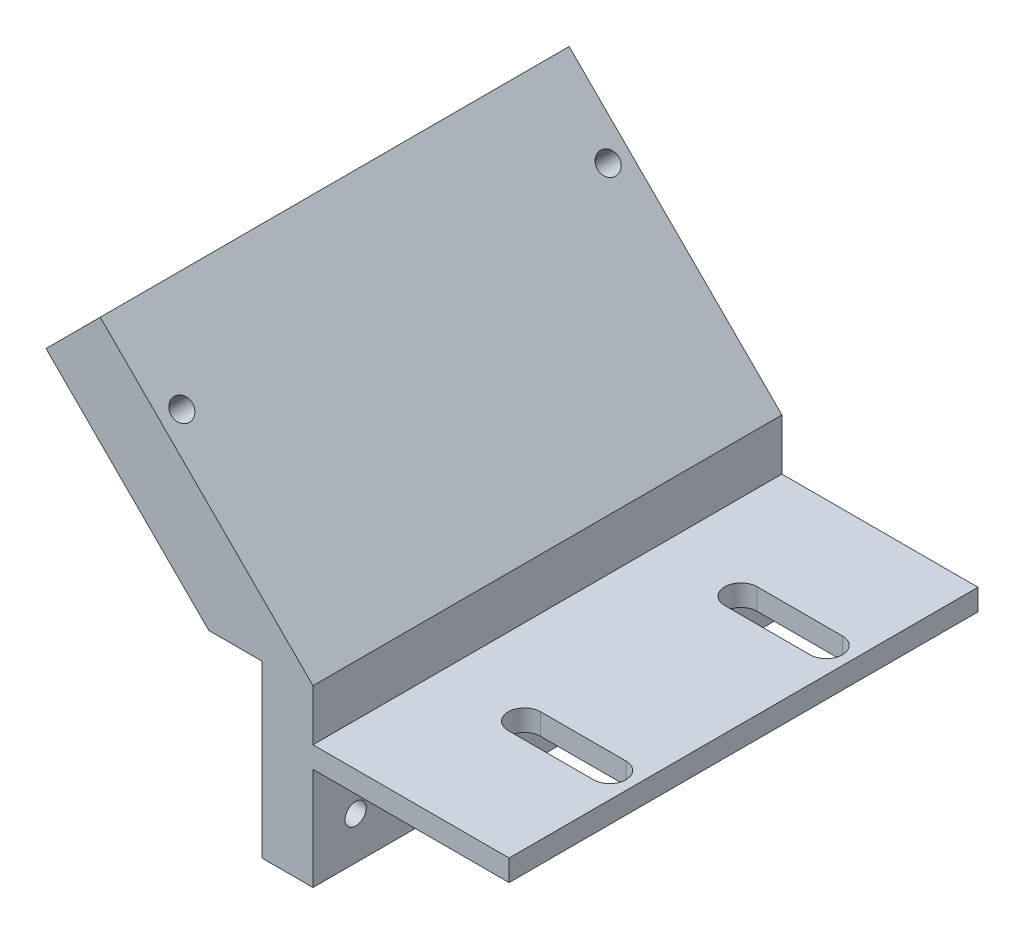
ISO-10303-21;
HEADER;
FILE_DESCRIPTION(('STEP AP214'),'2;1');
FILE_NAME('part.step','',(''),(''),'','','');
FILE_SCHEMA(('AUTOMOTIVE_DESIGN { 1 0 10303 214 1 1 1 1 }'));
ENDSEC;
DATA;
#1=APPLICATION_CONTEXT('core data for automotive mechanical design processes');
#2=APPLICATION_PROTOCOL_DEFINITION('international standard','automotive_design',2000,#1);
#3=PRODUCT_CONTEXT('',#1,'mechanical');
#4=PRODUCT('Part','Part','',(#3));
#5=PRODUCT_RELATED_PRODUCT_CATEGORY('part','',(#4));
#6=PRODUCT_DEFINITION_FORMATION('','',#4);
#7=PRODUCT_DEFINITION_CONTEXT('part definition',#1,'design');
#8=PRODUCT_DEFINITION('design','',#6,#7);
#9=PRODUCT_DEFINITION_SHAPE('','',#8);
#10=(LENGTH_UNIT() NAMED_UNIT(*) SI_UNIT(.MILLI.,.METRE.));
#11=(NAMED_UNIT(*) PLANE_ANGLE_UNIT() SI_UNIT($,.RADIAN.));
#12=(NAMED_UNIT(*) SI_UNIT($,.STERADIAN.) SOLID_ANGLE_UNIT());
#13=UNCERTAINTY_MEASURE_WITH_UNIT(LENGTH_MEASURE(1.E-05),#10,'distance_accuracy_value','');
#14=(GEOMETRIC_REPRESENTATION_CONTEXT(3) GLOBAL_UNCERTAINTY_ASSIGNED_CONTEXT((#13)) GLOBAL_UNIT_ASSIGNED_CONTEXT((#10,
#11,#12)) REPRESENTATION_CONTEXT('',''));
#15=CARTESIAN_POINT('',(0.,0.,0.));
#16=DIRECTION('',(0.,0.,1.));
#17=DIRECTION('',(1.,0.,0.));
#18=AXIS2_PLACEMENT_3D('',#15,#16,#17);
#19=CARTESIAN_POINT('',(0.,2.5,27.5));
#20=DIRECTION('',(-1.,0.,0.));
#21=DIRECTION('',(0.,0.,1.));
#22=AXIS2_PLACEMENT_3D('',#19,#20,#21);
#23=PLANE('',#22);
#24=DIRECTION('',(0.,1.,0.));
#25=VECTOR('',#24,1.);
#26=CARTESIAN_POINT('',(0.,2.5,-27.5));
#27=LINE('',#26,#25);
#28=CARTESIAN_POINT('',(0.,0.,-27.5));
#29=VERTEX_POINT('',#28);
#30=CARTESIAN_POINT('',(0.,2.5,-27.5));
#31=VERTEX_POINT('',#30);
#32=EDGE_CURVE('E181',#29,#31,#27,.T.);
#33=ORIENTED_EDGE('',*,*,#32,.T.);
#34=DIRECTION('',(0.,0.,-1.));
#35=VECTOR('',#34,1.);
#36=CARTESIAN_POINT('',(0.,2.5,27.5));
#37=LINE('',#36,#35);
#38=CARTESIAN_POINT('',(0.,2.5,27.5));
#39=VERTEX_POINT('',#38);
#40=EDGE_CURVE('E11',#39,#31,#37,.T.);
#41=ORIENTED_EDGE('',*,*,#40,.F.);
#42=DIRECTION('',(0.,1.,0.));
#43=VECTOR('',#42,1.);
#44=CARTESIAN_POINT('',(0.,2.5,27.5));
#45=LINE('',#44,#43);
#46=CARTESIAN_POINT('',(0.,0.,27.5));
#47=VERTEX_POINT('',#46);
#48=EDGE_CURVE('E235',#47,#39,#45,.T.);
#49=ORIENTED_EDGE('',*,*,#48,.F.);
#50=DIRECTION('',(0.,0.,-1.));
#51=VECTOR('',#50,1.);
#52=CARTESIAN_POINT('',(0.,0.,27.5));
#53=LINE('',#52,#51);
#54=EDGE_CURVE('E259',#47,#29,#53,.T.);
#55=ORIENTED_EDGE('',*,*,#54,.T.);
#56=EDGE_LOOP('',(#33,#41,#49,#55));
#57=FACE_BOUND('',#56,.T.);
#58=ADVANCED_FACE('F35',(#57),#23,.F.);
#59=CARTESIAN_POINT('',(-23.,2.5,27.5));
#60=DIRECTION('',(0.,-1.,0.));
#61=DIRECTION('',(1.,0.,0.));
#62=AXIS2_PLACEMENT_3D('',#59,#60,#61);
#63=PLANE('',#62);
#64=DIRECTION('',(1.,0.,0.));
#65=VECTOR('',#64,1.);
#66=CARTESIAN_POINT('',(-13.,2.5,14.605));
#67=LINE('',#66,#65);
#68=CARTESIAN_POINT('',(-13.,2.5,14.605));
#69=VERTEX_POINT('',#68);
#70=CARTESIAN_POINT('',(-3.,2.5,14.605));
#71=VERTEX_POINT('',#70);
#72=EDGE_CURVE('E189',#69,#71,#67,.T.);
#73=ORIENTED_EDGE('',*,*,#72,.F.);
#74=CARTESIAN_POINT('',(-13.,2.5,12.7));
#75=DIRECTION('',(0.,1.,0.));
#76=DIRECTION('',(0.,0.,1.));
#77=AXIS2_PLACEMENT_3D('',#74,#75,#76);
#78=CIRCLE('',#77,1.905);
#79=CARTESIAN_POINT('',(-13.,2.5,10.795));
#80=VERTEX_POINT('',#79);
#81=EDGE_CURVE('E49',#80,#69,#78,.T.);
#82=ORIENTED_EDGE('',*,*,#81,.F.);
#83=DIRECTION('',(-1.,0.,0.));
#84=VECTOR('',#83,1.);
#85=CARTESIAN_POINT('',(-13.,2.5,10.795));
#86=LINE('',#85,#84);
#87=CARTESIAN_POINT('',(-3.,2.5,10.795));
#88=VERTEX_POINT('',#87);
#89=EDGE_CURVE('E173',#88,#80,#86,.T.);
#90=ORIENTED_EDGE('',*,*,#89,.F.);
#91=CARTESIAN_POINT('',(-3.,2.5,12.7));
#92=DIRECTION('',(0.,1.,0.));
#93=DIRECTION('',(0.,0.,1.));
#94=AXIS2_PLACEMENT_3D('',#91,#92,#93);
#95=CIRCLE('',#94,1.905);
#96=EDGE_CURVE('E196',#71,#88,#95,.T.);
#97=ORIENTED_EDGE('',*,*,#96,.F.);
#98=EDGE_LOOP('',(#73,#82,#90,#97));
#99=FACE_BOUND('',#98,.T.);
#100=DIRECTION('',(1.,0.,0.));
#101=VECTOR('',#100,1.);
#102=CARTESIAN_POINT('',(-13.,2.5,-10.795));
#103=LINE('',#102,#101);
#104=CARTESIAN_POINT('',(-13.,2.5,-10.795));
#105=VERTEX_POINT('',#104);
#106=CARTESIAN_POINT('',(-3.,2.5,-10.795));
#107=VERTEX_POINT('',#106);
#108=EDGE_CURVE('E215',#105,#107,#103,.T.);
#109=ORIENTED_EDGE('',*,*,#108,.F.);
#110=CARTESIAN_POINT('',(-13.,2.5,-12.7));
#111=DIRECTION('',(0.,1.,0.));
#112=DIRECTION('',(0.,0.,-1.));
#113=AXIS2_PLACEMENT_3D('',#110,#111,#112);
#114=CIRCLE('',#113,1.905);
#115=CARTESIAN_POINT('',(-13.,2.5,-14.605));
#116=VERTEX_POINT('',#115);
#117=EDGE_CURVE('E57',#116,#105,#114,.T.);
#118=ORIENTED_EDGE('',*,*,#117,.F.);
#119=DIRECTION('',(-1.,0.,0.));
#120=VECTOR('',#119,1.);
#121=CARTESIAN_POINT('',(-13.,2.5,-14.605));
#122=LINE('',#121,#120);
#123=CARTESIAN_POINT('',(-3.,2.5,-14.605));
#124=VERTEX_POINT('',#123);
#125=EDGE_CURVE('E221',#124,#116,#122,.T.);
#126=ORIENTED_EDGE('',*,*,#125,.F.);
#127=CARTESIAN_POINT('',(-3.,2.5,-12.7));
#128=DIRECTION('',(0.,1.,0.));
#129=DIRECTION('',(0.,0.,-1.));
#130=AXIS2_PLACEMENT_3D('',#127,#128,#129);
#131=CIRCLE('',#130,1.905);
#132=EDGE_CURVE('E218',#107,#124,#131,.T.);
#133=ORIENTED_EDGE('',*,*,#132,.F.);
#134=EDGE_LOOP('',(#109,#118,#126,#133));
#135=FACE_BOUND('',#134,.T.);
#136=DIRECTION('',(-1.,0.,0.));
#137=VECTOR('',#136,1.);
#138=CARTESIAN_POINT('',(-23.,2.5,-27.5));
#139=LINE('',#138,#137);
#140=CARTESIAN_POINT('',(-23.,2.5,-27.5));
#141=VERTEX_POINT('',#140);
#142=EDGE_CURVE('E262',#31,#141,#139,.T.);
#143=ORIENTED_EDGE('',*,*,#142,.T.);
#144=DIRECTION('',(0.,0.,-1.));
#145=VECTOR('',#144,1.);
#146=CARTESIAN_POINT('',(-23.,2.5,27.5));
#147=LINE('',#146,#145);
#148=CARTESIAN_POINT('',(-23.,2.5,27.5));
#149=VERTEX_POINT('',#148);
#150=EDGE_CURVE('E42',#149,#141,#147,.T.);
#151=ORIENTED_EDGE('',*,*,#150,.F.);
#152=DIRECTION('',(-1.,0.,0.));
#153=VECTOR('',#152,1.);
#154=CARTESIAN_POINT('',(-23.,2.5,27.5));
#155=LINE('',#154,#153);
#156=EDGE_CURVE('E238',#39,#149,#155,.T.);
#157=ORIENTED_EDGE('',*,*,#156,.F.);
#158=ORIENTED_EDGE('',*,*,#40,.T.);
#159=EDGE_LOOP('',(#143,#151,#157,#158));
#160=FACE_BOUND('',#159,.T.);
#161=ADVANCED_FACE('F334',(#99,#135,#160),#63,.F.);
#162=CARTESIAN_POINT('',(-23.,8.5,27.5));
#163=DIRECTION('',(-1.,0.,0.));
#164=DIRECTION('',(0.,-1.,0.));
#165=AXIS2_PLACEMENT_3D('',#162,#163,#164);
#166=PLANE('',#165);
#167=DIRECTION('',(0.,1.,0.));
#168=VECTOR('',#167,1.);
#169=CARTESIAN_POINT('',(-23.,8.5,-27.5));
#170=LINE('',#169,#168);
#171=CARTESIAN_POINT('',(-23.,8.5,-27.5));
#172=VERTEX_POINT('',#171);
#173=EDGE_CURVE('E264',#141,#172,#170,.T.);
#174=ORIENTED_EDGE('',*,*,#173,.T.);
#175=DIRECTION('',(0.,0.,-1.));
#176=VECTOR('',#175,1.);
#177=CARTESIAN_POINT('',(-23.,8.5,27.5));
#178=LINE('',#177,#176);
#179=CARTESIAN_POINT('',(-23.,8.5,27.5));
#180=VERTEX_POINT('',#179);
#181=EDGE_CURVE('E304',#180,#172,#178,.T.);
#182=ORIENTED_EDGE('',*,*,#181,.F.);
#183=DIRECTION('',(0.,1.,0.));
#184=VECTOR('',#183,1.);
#185=CARTESIAN_POINT('',(-23.,8.5,27.5));
#186=LINE('',#185,#184);
#187=EDGE_CURVE('E241',#149,#180,#186,.T.);
#188=ORIENTED_EDGE('',*,*,#187,.F.);
#189=ORIENTED_EDGE('',*,*,#150,.T.);
#190=EDGE_LOOP('',(#174,#182,#188,#189));
#191=FACE_BOUND('',#190,.T.);
#192=ADVANCED_FACE('F311',(#191),#166,.F.);
#193=CARTESIAN_POINT('',(-47.9558441227156,33.4558441227157,27.5));
#194=DIRECTION('',(-0.707106781186549,-0.707106781186546,0.));
#195=DIRECTION('',(0.707106781186546,-0.707106781186549,0.));
#196=AXIS2_PLACEMENT_3D('',#193,#194,#195);
#197=PLANE('',#196);
#198=CARTESIAN_POINT('',(-40.8847763108501,26.3847763108502,25.));
#199=DIRECTION('',(0.707106781186548,0.707106781186547,0.));
#200=DIRECTION('',(-0.707106781186547,0.707106781186548,0.));
#201=AXIS2_PLACEMENT_3D('',#198,#199,#200);
#202=CIRCLE('',#201,1.25);
#203=CARTESIAN_POINT('',(-41.7686597873333,27.2686597873333,25.));
#204=VERTEX_POINT('',#203);
#205=EDGE_CURVE('E391',#204,#204,#202,.T.);
#206=ORIENTED_EDGE('',*,*,#205,.F.);
#207=EDGE_LOOP('',(#206));
#208=FACE_BOUND('',#207,.T.);
#209=CARTESIAN_POINT('',(-40.8847763108501,26.3847763108502,-25.));
#210=DIRECTION('',(0.707106781186548,0.707106781186547,0.));
#211=DIRECTION('',(-0.707106781186547,0.707106781186548,0.));
#212=AXIS2_PLACEMENT_3D('',#209,#210,#211);
#213=CIRCLE('',#212,1.25);
#214=CARTESIAN_POINT('',(-41.7686597873333,27.2686597873333,-25.));
#215=VERTEX_POINT('',#214);
#216=EDGE_CURVE('E394',#215,#215,#213,.T.);
#217=ORIENTED_EDGE('',*,*,#216,.F.);
#218=EDGE_LOOP('',(#217));
#219=FACE_BOUND('',#218,.T.);
#220=DIRECTION('',(-0.707106781186546,0.707106781186549,0.));
#221=VECTOR('',#220,1.);
#222=CARTESIAN_POINT('',(-47.9558441227156,33.4558441227157,-27.5));
#223=LINE('',#222,#221);
#224=CARTESIAN_POINT('',(-47.9558441227156,33.4558441227157,-27.5));
#225=VERTEX_POINT('',#224);
#226=EDGE_CURVE('E266',#172,#225,#223,.T.);
#227=ORIENTED_EDGE('',*,*,#226,.T.);
#228=DIRECTION('',(0.,0.,-1.));
#229=VECTOR('',#228,1.);
#230=CARTESIAN_POINT('',(-47.9558441227156,33.4558441227157,27.5));
#231=LINE('',#230,#229);
#232=CARTESIAN_POINT('',(-47.9558441227156,33.4558441227157,27.5));
#233=VERTEX_POINT('',#232);
#234=EDGE_CURVE('E301',#233,#225,#231,.T.);
#235=ORIENTED_EDGE('',*,*,#234,.F.);
#236=DIRECTION('',(-0.707106781186546,0.707106781186549,0.));
#237=VECTOR('',#236,1.);
#238=CARTESIAN_POINT('',(-47.9558441227156,33.4558441227157,27.5));
#239=LINE('',#238,#237);
#240=EDGE_CURVE('E243',#180,#233,#239,.T.);
#241=ORIENTED_EDGE('',*,*,#240,.F.);
#242=ORIENTED_EDGE('',*,*,#181,.T.);
#243=EDGE_LOOP('',(#227,#235,#241,#242));
#244=FACE_BOUND('',#243,.T.);
#245=ADVANCED_FACE('F322',(#208,#219,#244),#197,.F.);
#246=CARTESIAN_POINT('',(-54.3198051533945,27.0918830920367,27.5));
#247=DIRECTION('',(0.707106781186547,-0.707106781186548,0.));
#248=DIRECTION('',(0.707106781186548,0.707106781186547,0.));
#249=AXIS2_PLACEMENT_3D('',#246,#247,#248);
#250=PLANE('',#249);
#251=DIRECTION('',(-0.707106781186548,-0.707106781186547,0.));
#252=VECTOR('',#251,1.);
#253=CARTESIAN_POINT('',(-54.3198051533945,27.0918830920367,-27.5));
#254=LINE('',#253,#252);
#255=CARTESIAN_POINT('',(-54.3198051533945,27.0918830920367,-27.5));
#256=VERTEX_POINT('',#255);
#257=EDGE_CURVE('E268',#225,#256,#254,.T.);
#258=ORIENTED_EDGE('',*,*,#257,.T.);
#259=DIRECTION('',(0.,0.,-1.));
#260=VECTOR('',#259,1.);
#261=CARTESIAN_POINT('',(-54.3198051533945,27.0918830920367,27.5));
#262=LINE('',#261,#260);
#263=CARTESIAN_POINT('',(-54.3198051533945,27.0918830920367,27.5));
#264=VERTEX_POINT('',#263);
#265=EDGE_CURVE('E298',#264,#256,#262,.T.);
#266=ORIENTED_EDGE('',*,*,#265,.F.);
#267=DIRECTION('',(-0.707106781186548,-0.707106781186547,0.));
#268=VECTOR('',#267,1.);
#269=CARTESIAN_POINT('',(-54.3198051533945,27.0918830920367,27.5));
#270=LINE('',#269,#268);
#271=EDGE_CURVE('E245',#233,#264,#270,.T.);
#272=ORIENTED_EDGE('',*,*,#271,.F.);
#273=ORIENTED_EDGE('',*,*,#234,.T.);
#274=EDGE_LOOP('',(#258,#266,#272,#273));
#275=FACE_BOUND('',#274,.T.);
#276=ADVANCED_FACE('F326',(#275),#250,.F.);
#277=CARTESIAN_POINT('',(-35.2279220613577,7.99999999999996,27.5));
#278=DIRECTION('',(0.707106781186547,0.707106781186547,0.));
#279=DIRECTION('',(-0.707106781186548,0.707106781186548,0.));
#280=AXIS2_PLACEMENT_3D('',#277,#278,#279);
#281=PLANE('',#280);
#282=CARTESIAN_POINT('',(-47.248737341529,20.0208152801713,25.));
#283=DIRECTION('',(0.707106781186547,0.707106781186547,0.));
#284=DIRECTION('',(-0.707106781186548,0.707106781186548,0.));
#285=AXIS2_PLACEMENT_3D('',#282,#283,#284);
#286=CIRCLE('',#285,1.25);
#287=CARTESIAN_POINT('',(-48.1326208180122,20.9046987566545,25.));
#288=VERTEX_POINT('',#287);
#289=EDGE_CURVE('E401',#288,#288,#286,.F.);
#290=ORIENTED_EDGE('',*,*,#289,.F.);
#291=EDGE_LOOP('',(#290));
#292=FACE_BOUND('',#291,.T.);
#293=CARTESIAN_POINT('',(-47.248737341529,20.0208152801713,-25.));
#294=DIRECTION('',(0.707106781186547,0.707106781186547,0.));
#295=DIRECTION('',(-0.707106781186548,0.707106781186548,0.));
#296=AXIS2_PLACEMENT_3D('',#293,#294,#295);
#297=CIRCLE('',#296,1.25);
#298=CARTESIAN_POINT('',(-48.1326208180122,20.9046987566545,-25.));
#299=VERTEX_POINT('',#298);
#300=EDGE_CURVE('E396',#299,#299,#297,.F.);
#301=ORIENTED_EDGE('',*,*,#300,.F.);
#302=EDGE_LOOP('',(#301));
#303=FACE_BOUND('',#302,.T.);
#304=DIRECTION('',(0.707106781186547,-0.707106781186547,0.));
#305=VECTOR('',#304,1.);
#306=CARTESIAN_POINT('',(-35.2279220613577,7.99999999999996,-27.5));
#307=LINE('',#306,#305);
#308=CARTESIAN_POINT('',(-35.2279220613577,7.99999999999996,-27.5));
#309=VERTEX_POINT('',#308);
#310=EDGE_CURVE('E270',#256,#309,#307,.T.);
#311=ORIENTED_EDGE('',*,*,#310,.T.);
#312=DIRECTION('',(0.,0.,-1.));
#313=VECTOR('',#312,1.);
#314=CARTESIAN_POINT('',(-35.2279220613577,7.99999999999996,27.5));
#315=LINE('',#314,#313);
#316=CARTESIAN_POINT('',(-35.2279220613577,7.99999999999996,27.5));
#317=VERTEX_POINT('',#316);
#318=EDGE_CURVE('E295',#317,#309,#315,.T.);
#319=ORIENTED_EDGE('',*,*,#318,.F.);
#320=DIRECTION('',(0.707106781186547,-0.707106781186547,0.));
#321=VECTOR('',#320,1.);
#322=CARTESIAN_POINT('',(-35.2279220613577,7.99999999999996,27.5));
#323=LINE('',#322,#321);
#324=EDGE_CURVE('E247',#264,#317,#323,.T.);
#325=ORIENTED_EDGE('',*,*,#324,.F.);
#326=ORIENTED_EDGE('',*,*,#265,.T.);
#327=EDGE_LOOP('',(#311,#319,#325,#326));
#328=FACE_BOUND('',#327,.T.);
#329=ADVANCED_FACE('F361',(#292,#303,#328),#281,.F.);
#330=CARTESIAN_POINT('',(-29.,8.,27.5));
#331=DIRECTION('',(0.,1.,0.));
#332=DIRECTION('',(-1.,0.,0.));
#333=AXIS2_PLACEMENT_3D('',#330,#331,#332);
#334=PLANE('',#333);
#335=DIRECTION('',(1.,0.,0.));
#336=VECTOR('',#335,1.);
#337=CARTESIAN_POINT('',(-29.,8.,-27.5));
#338=LINE('',#337,#336);
#339=CARTESIAN_POINT('',(-29.,8.,-27.5));
#340=VERTEX_POINT('',#339);
#341=EDGE_CURVE('E272',#309,#340,#338,.T.);
#342=ORIENTED_EDGE('',*,*,#341,.T.);
#343=DIRECTION('',(0.,0.,-1.));
#344=VECTOR('',#343,1.);
#345=CARTESIAN_POINT('',(-29.,8.,27.5));
#346=LINE('',#345,#344);
#347=CARTESIAN_POINT('',(-29.,8.,27.5));
#348=VERTEX_POINT('',#347);
#349=EDGE_CURVE('E292',#348,#340,#346,.T.);
#350=ORIENTED_EDGE('',*,*,#349,.F.);
#351=DIRECTION('',(1.,0.,0.));
#352=VECTOR('',#351,1.);
#353=CARTESIAN_POINT('',(-29.,8.,27.5));
#354=LINE('',#353,#352);
#355=EDGE_CURVE('E249',#317,#348,#354,.T.);
#356=ORIENTED_EDGE('',*,*,#355,.F.);
#357=ORIENTED_EDGE('',*,*,#318,.T.);
#358=EDGE_LOOP('',(#342,#350,#356,#357));
#359=FACE_BOUND('',#358,.T.);
#360=ADVANCED_FACE('F359',(#359),#334,.F.);
#361=CARTESIAN_POINT('',(-29.,-12.,27.5));
#362=DIRECTION('',(1.,0.,0.));
#363=DIRECTION('',(0.,0.,-1.));
#364=AXIS2_PLACEMENT_3D('',#361,#362,#363);
#365=PLANE('',#364);
#366=CARTESIAN_POINT('',(-29.,-7.,22.5));
#367=DIRECTION('',(1.,0.,0.));
#368=DIRECTION('',(0.,0.,-1.));
#369=AXIS2_PLACEMENT_3D('',#366,#367,#368);
#370=CIRCLE('',#369,1.25);
#371=CARTESIAN_POINT('',(-29.,-7.,21.25));
#372=VERTEX_POINT('',#371);
#373=EDGE_CURVE('E208',#372,#372,#370,.F.);
#374=ORIENTED_EDGE('',*,*,#373,.F.);
#375=EDGE_LOOP('',(#374));
#376=FACE_BOUND('',#375,.T.);
#377=CARTESIAN_POINT('',(-29.,-7.,-22.5));
#378=DIRECTION('',(1.,0.,0.));
#379=DIRECTION('',(0.,0.,-1.));
#380=AXIS2_PLACEMENT_3D('',#377,#378,#379);
#381=CIRCLE('',#380,1.25);
#382=CARTESIAN_POINT('',(-29.,-7.,-23.75));
#383=VERTEX_POINT('',#382);
#384=EDGE_CURVE('E407',#383,#383,#381,.F.);
#385=ORIENTED_EDGE('',*,*,#384,.F.);
#386=EDGE_LOOP('',(#385));
#387=FACE_BOUND('',#386,.T.);
#388=DIRECTION('',(0.,-1.,0.));
#389=VECTOR('',#388,1.);
#390=CARTESIAN_POINT('',(-29.,-12.,-27.5));
#391=LINE('',#390,#389);
#392=CARTESIAN_POINT('',(-29.,-12.,-27.5));
#393=VERTEX_POINT('',#392);
#394=EDGE_CURVE('E274',#340,#393,#391,.T.);
#395=ORIENTED_EDGE('',*,*,#394,.T.);
#396=DIRECTION('',(0.,0.,-1.));
#397=VECTOR('',#396,1.);
#398=CARTESIAN_POINT('',(-29.,-12.,27.5));
#399=LINE('',#398,#397);
#400=CARTESIAN_POINT('',(-29.,-12.,27.5));
#401=VERTEX_POINT('',#400);
#402=EDGE_CURVE('E289',#401,#393,#399,.T.);
#403=ORIENTED_EDGE('',*,*,#402,.F.);
#404=DIRECTION('',(0.,-1.,0.));
#405=VECTOR('',#404,1.);
#406=CARTESIAN_POINT('',(-29.,-12.,27.5));
#407=LINE('',#406,#405);
#408=EDGE_CURVE('E251',#348,#401,#407,.T.);
#409=ORIENTED_EDGE('',*,*,#408,.F.);
#410=ORIENTED_EDGE('',*,*,#349,.T.);
#411=EDGE_LOOP('',(#395,#403,#409,#410));
#412=FACE_BOUND('',#411,.T.);
#413=ADVANCED_FACE('F354',(#376,#387,#412),#365,.F.);
#414=CARTESIAN_POINT('',(-23.,-12.,27.5));
#415=DIRECTION('',(0.,1.,0.));
#416=DIRECTION('',(0.,0.,1.));
#417=AXIS2_PLACEMENT_3D('',#414,#415,#416);
#418=PLANE('',#417);
#419=DIRECTION('',(1.,0.,0.));
#420=VECTOR('',#419,1.);
#421=CARTESIAN_POINT('',(-23.,-12.,-27.5));
#422=LINE('',#421,#420);
#423=CARTESIAN_POINT('',(-23.,-12.,-27.5));
#424=VERTEX_POINT('',#423);
#425=EDGE_CURVE('E276',#393,#424,#422,.T.);
#426=ORIENTED_EDGE('',*,*,#425,.T.);
#427=DIRECTION('',(0.,0.,-1.));
#428=VECTOR('',#427,1.);
#429=CARTESIAN_POINT('',(-23.,-12.,27.5));
#430=LINE('',#429,#428);
#431=CARTESIAN_POINT('',(-23.,-12.,27.5));
#432=VERTEX_POINT('',#431);
#433=EDGE_CURVE('E286',#432,#424,#430,.T.);
#434=ORIENTED_EDGE('',*,*,#433,.F.);
#435=DIRECTION('',(1.,0.,0.));
#436=VECTOR('',#435,1.);
#437=CARTESIAN_POINT('',(-23.,-12.,27.5));
#438=LINE('',#437,#436);
#439=EDGE_CURVE('E253',#401,#432,#438,.T.);
#440=ORIENTED_EDGE('',*,*,#439,.F.);
#441=ORIENTED_EDGE('',*,*,#402,.T.);
#442=EDGE_LOOP('',(#426,#434,#440,#441));
#443=FACE_BOUND('',#442,.T.);
#444=ADVANCED_FACE('F349',(#443),#418,.F.);
#445=CARTESIAN_POINT('',(-23.,0.,27.5));
#446=DIRECTION('',(-1.,0.,0.));
#447=DIRECTION('',(0.,0.,1.));
#448=AXIS2_PLACEMENT_3D('',#445,#446,#447);
#449=PLANE('',#448);
#450=CARTESIAN_POINT('',(-23.,-7.,22.5));
#451=DIRECTION('',(1.,0.,0.));
#452=DIRECTION('',(0.,0.,-1.));
#453=AXIS2_PLACEMENT_3D('',#450,#451,#452);
#454=CIRCLE('',#453,1.25);
#455=CARTESIAN_POINT('',(-23.,-7.,21.25));
#456=VERTEX_POINT('',#455);
#457=EDGE_CURVE('E404',#456,#456,#454,.T.);
#458=ORIENTED_EDGE('',*,*,#457,.F.);
#459=EDGE_LOOP('',(#458));
#460=FACE_BOUND('',#459,.T.);
#461=CARTESIAN_POINT('',(-23.,-7.,-22.5));
#462=DIRECTION('',(1.,0.,0.));
#463=DIRECTION('',(0.,0.,-1.));
#464=AXIS2_PLACEMENT_3D('',#461,#462,#463);
#465=CIRCLE('',#464,1.25);
#466=CARTESIAN_POINT('',(-23.,-7.,-23.75));
#467=VERTEX_POINT('',#466);
#468=EDGE_CURVE('E410',#467,#467,#465,.T.);
#469=ORIENTED_EDGE('',*,*,#468,.F.);
#470=EDGE_LOOP('',(#469));
#471=FACE_BOUND('',#470,.T.);
#472=DIRECTION('',(0.,1.,0.));
#473=VECTOR('',#472,1.);
#474=CARTESIAN_POINT('',(-23.,0.,-27.5));
#475=LINE('',#474,#473);
#476=CARTESIAN_POINT('',(-23.,0.,-27.5));
#477=VERTEX_POINT('',#476);
#478=EDGE_CURVE('E278',#424,#477,#475,.T.);
#479=ORIENTED_EDGE('',*,*,#478,.T.);
#480=DIRECTION('',(0.,0.,-1.));
#481=VECTOR('',#480,1.);
#482=CARTESIAN_POINT('',(-23.,0.,27.5));
#483=LINE('',#482,#481);
#484=CARTESIAN_POINT('',(-23.,0.,27.5));
#485=VERTEX_POINT('',#484);
#486=EDGE_CURVE('E283',#485,#477,#483,.T.);
#487=ORIENTED_EDGE('',*,*,#486,.F.);
#488=DIRECTION('',(0.,1.,0.));
#489=VECTOR('',#488,1.);
#490=CARTESIAN_POINT('',(-23.,0.,27.5));
#491=LINE('',#490,#489);
#492=EDGE_CURVE('E255',#432,#485,#491,.T.);
#493=ORIENTED_EDGE('',*,*,#492,.F.);
#494=ORIENTED_EDGE('',*,*,#433,.T.);
#495=EDGE_LOOP('',(#479,#487,#493,#494));
#496=FACE_BOUND('',#495,.T.);
#497=ADVANCED_FACE('F345',(#460,#471,#496),#449,.F.);
#498=CARTESIAN_POINT('',(0.,0.,27.5));
#499=DIRECTION('',(0.,1.,0.));
#500=DIRECTION('',(-1.,0.,0.));
#501=AXIS2_PLACEMENT_3D('',#498,#499,#500);
#502=PLANE('',#501);
#503=DIRECTION('',(1.,0.,0.));
#504=VECTOR('',#503,1.);
#505=CARTESIAN_POINT('',(-13.,0.,10.795));
#506=LINE('',#505,#504);
#507=CARTESIAN_POINT('',(-13.,0.,10.795));
#508=VERTEX_POINT('',#507);
#509=CARTESIAN_POINT('',(-3.,0.,10.795));
#510=VERTEX_POINT('',#509);
#511=EDGE_CURVE('E187',#508,#510,#506,.T.);
#512=ORIENTED_EDGE('',*,*,#511,.F.);
#513=CARTESIAN_POINT('',(-13.,0.,12.7));
#514=DIRECTION('',(0.,1.,0.));
#515=DIRECTION('',(-1.,0.,0.));
#516=AXIS2_PLACEMENT_3D('',#513,#514,#515);
#517=CIRCLE('',#516,1.905);
#518=CARTESIAN_POINT('',(-13.,0.,14.605));
#519=VERTEX_POINT('',#518);
#520=EDGE_CURVE('E167',#519,#508,#517,.F.);
#521=ORIENTED_EDGE('',*,*,#520,.F.);
#522=DIRECTION('',(-1.,0.,0.));
#523=VECTOR('',#522,1.);
#524=CARTESIAN_POINT('',(-13.,0.,14.605));
#525=LINE('',#524,#523);
#526=CARTESIAN_POINT('',(-3.,0.,14.605));
#527=VERTEX_POINT('',#526);
#528=EDGE_CURVE('E177',#527,#519,#525,.T.);
#529=ORIENTED_EDGE('',*,*,#528,.F.);
#530=CARTESIAN_POINT('',(-3.,0.,12.7));
#531=DIRECTION('',(0.,1.,0.));
#532=DIRECTION('',(-1.,0.,0.));
#533=AXIS2_PLACEMENT_3D('',#530,#531,#532);
#534=CIRCLE('',#533,1.905);
#535=EDGE_CURVE('E191',#510,#527,#534,.F.);
#536=ORIENTED_EDGE('',*,*,#535,.F.);
#537=EDGE_LOOP('',(#512,#521,#529,#536));
#538=FACE_BOUND('',#537,.T.);
#539=DIRECTION('',(1.,0.,0.));
#540=VECTOR('',#539,1.);
#541=CARTESIAN_POINT('',(-13.,0.,-14.605));
#542=LINE('',#541,#540);
#543=CARTESIAN_POINT('',(-13.,0.,-14.605));
#544=VERTEX_POINT('',#543);
#545=CARTESIAN_POINT('',(-3.,0.,-14.605));
#546=VERTEX_POINT('',#545);
#547=EDGE_CURVE('E207',#544,#546,#542,.T.);
#548=ORIENTED_EDGE('',*,*,#547,.F.);
#549=CARTESIAN_POINT('',(-13.,0.,-12.7));
#550=DIRECTION('',(0.,1.,0.));
#551=DIRECTION('',(-1.,0.,0.));
#552=AXIS2_PLACEMENT_3D('',#549,#550,#551);
#553=CIRCLE('',#552,1.905);
#554=CARTESIAN_POINT('',(-13.,0.,-10.795));
#555=VERTEX_POINT('',#554);
#556=EDGE_CURVE('E211',#555,#544,#553,.F.);
#557=ORIENTED_EDGE('',*,*,#556,.F.);
#558=DIRECTION('',(-1.,0.,0.));
#559=VECTOR('',#558,1.);
#560=CARTESIAN_POINT('',(-13.,0.,-10.795));
#561=LINE('',#560,#559);
#562=CARTESIAN_POINT('',(-3.,0.,-10.795));
#563=VERTEX_POINT('',#562);
#564=EDGE_CURVE('E227',#563,#555,#561,.T.);
#565=ORIENTED_EDGE('',*,*,#564,.F.);
#566=CARTESIAN_POINT('',(-3.,0.,-12.7));
#567=DIRECTION('',(0.,1.,0.));
#568=DIRECTION('',(-1.,0.,0.));
#569=AXIS2_PLACEMENT_3D('',#566,#567,#568);
#570=CIRCLE('',#569,1.905);
#571=EDGE_CURVE('E205',#546,#563,#570,.F.);
#572=ORIENTED_EDGE('',*,*,#571,.F.);
#573=EDGE_LOOP('',(#548,#557,#565,#572));
#574=FACE_BOUND('',#573,.T.);
#575=DIRECTION('',(1.,0.,0.));
#576=VECTOR('',#575,1.);
#577=CARTESIAN_POINT('',(0.,0.,-27.5));
#578=LINE('',#577,#576);
#579=EDGE_CURVE('E239',#477,#29,#578,.T.);
#580=ORIENTED_EDGE('',*,*,#579,.T.);
#581=ORIENTED_EDGE('',*,*,#54,.F.);
#582=DIRECTION('',(1.,0.,0.));
#583=VECTOR('',#582,1.);
#584=CARTESIAN_POINT('',(0.,0.,27.5));
#585=LINE('',#584,#583);
#586=EDGE_CURVE('E257',#485,#47,#585,.T.);
#587=ORIENTED_EDGE('',*,*,#586,.F.);
#588=ORIENTED_EDGE('',*,*,#486,.T.);
#589=EDGE_LOOP('',(#580,#581,#587,#588));
#590=FACE_BOUND('',#589,.T.);
#591=ADVANCED_FACE('F184',(#538,#574,#590),#502,.F.);
#592=CARTESIAN_POINT('',(0.,0.,27.5));
#593=DIRECTION('',(0.,0.,-1.));
#594=DIRECTION('',(-1.,0.,0.));
#595=AXIS2_PLACEMENT_3D('',#592,#593,#594);
#596=PLANE('',#595);
#597=ORIENTED_EDGE('',*,*,#48,.T.);
#598=ORIENTED_EDGE('',*,*,#156,.T.);
#599=ORIENTED_EDGE('',*,*,#187,.T.);
#600=ORIENTED_EDGE('',*,*,#240,.T.);
#601=ORIENTED_EDGE('',*,*,#271,.T.);
#602=ORIENTED_EDGE('',*,*,#324,.T.);
#603=ORIENTED_EDGE('',*,*,#355,.T.);
#604=ORIENTED_EDGE('',*,*,#408,.T.);
#605=ORIENTED_EDGE('',*,*,#439,.T.);
#606=ORIENTED_EDGE('',*,*,#492,.T.);
#607=ORIENTED_EDGE('',*,*,#586,.T.);
#608=EDGE_LOOP('',(#597,#598,#599,#600,#601,#602,#603,#604,#605,#606,#607));
#609=FACE_BOUND('',#608,.T.);
#610=ADVANCED_FACE('F330',(#609),#596,.F.);
#611=CARTESIAN_POINT('',(0.,0.,-27.5));
#612=DIRECTION('',(0.,0.,-1.));
#613=DIRECTION('',(-1.,0.,0.));
#614=AXIS2_PLACEMENT_3D('',#611,#612,#613);
#615=PLANE('',#614);
#616=ORIENTED_EDGE('',*,*,#32,.F.);
#617=ORIENTED_EDGE('',*,*,#579,.F.);
#618=ORIENTED_EDGE('',*,*,#478,.F.);
#619=ORIENTED_EDGE('',*,*,#425,.F.);
#620=ORIENTED_EDGE('',*,*,#394,.F.);
#621=ORIENTED_EDGE('',*,*,#341,.F.);
#622=ORIENTED_EDGE('',*,*,#310,.F.);
#623=ORIENTED_EDGE('',*,*,#257,.F.);
#624=ORIENTED_EDGE('',*,*,#226,.F.);
#625=ORIENTED_EDGE('',*,*,#173,.F.);
#626=ORIENTED_EDGE('',*,*,#142,.F.);
#627=EDGE_LOOP('',(#616,#617,#618,#619,#620,#621,#622,#623,#624,#625,#626));
#628=FACE_BOUND('',#627,.T.);
#629=ADVANCED_FACE('F317',(#628),#615,.T.);
#630=CARTESIAN_POINT('',(-13.,-12.001,-12.7));
#631=DIRECTION('',(0.,1.,0.));
#632=DIRECTION('',(0.,0.,1.));
#633=AXIS2_PLACEMENT_3D('',#630,#631,#632);
#634=CYLINDRICAL_SURFACE('',#633,1.905);
#635=ORIENTED_EDGE('',*,*,#556,.T.);
#636=DIRECTION('',(0.,1.,0.));
#637=VECTOR('',#636,1.);
#638=CARTESIAN_POINT('',(-13.,-12.001,-14.605));
#639=LINE('',#638,#637);
#640=EDGE_CURVE('E225',#544,#116,#639,.T.);
#641=ORIENTED_EDGE('',*,*,#640,.T.);
#642=ORIENTED_EDGE('',*,*,#117,.T.);
#643=DIRECTION('',(0.,1.,0.));
#644=VECTOR('',#643,1.);
#645=CARTESIAN_POINT('',(-13.,-12.001,-10.795));
#646=LINE('',#645,#644);
#647=EDGE_CURVE('E224',#555,#105,#646,.T.);
#648=ORIENTED_EDGE('',*,*,#647,.F.);
#649=EDGE_LOOP('',(#635,#641,#642,#648));
#650=FACE_BOUND('',#649,.T.);
#651=ADVANCED_FACE('F439',(#650),#634,.F.);
#652=CARTESIAN_POINT('',(-13.,-12.001,-14.605));
#653=DIRECTION('',(0.,0.,-1.));
#654=DIRECTION('',(-1.,0.,0.));
#655=AXIS2_PLACEMENT_3D('',#652,#653,#654);
#656=PLANE('',#655);
#657=ORIENTED_EDGE('',*,*,#547,.T.);
#658=DIRECTION('',(0.,1.,0.));
#659=VECTOR('',#658,1.);
#660=CARTESIAN_POINT('',(-3.,-12.001,-14.605));
#661=LINE('',#660,#659);
#662=EDGE_CURVE('E228',#546,#124,#661,.T.);
#663=ORIENTED_EDGE('',*,*,#662,.T.);
#664=ORIENTED_EDGE('',*,*,#125,.T.);
#665=ORIENTED_EDGE('',*,*,#640,.F.);
#666=EDGE_LOOP('',(#657,#663,#664,#665));
#667=FACE_BOUND('',#666,.T.);
#668=ADVANCED_FACE('F435',(#667),#656,.F.);
#669=CARTESIAN_POINT('',(-3.,-12.001,-12.7));
#670=DIRECTION('',(0.,1.,0.));
#671=DIRECTION('',(0.,0.,1.));
#672=AXIS2_PLACEMENT_3D('',#669,#670,#671);
#673=CYLINDRICAL_SURFACE('',#672,1.905);
#674=ORIENTED_EDGE('',*,*,#571,.T.);
#675=DIRECTION('',(0.,1.,0.));
#676=VECTOR('',#675,1.);
#677=CARTESIAN_POINT('',(-3.,-12.001,-10.795));
#678=LINE('',#677,#676);
#679=EDGE_CURVE('E230',#563,#107,#678,.T.);
#680=ORIENTED_EDGE('',*,*,#679,.T.);
#681=ORIENTED_EDGE('',*,*,#132,.T.);
#682=ORIENTED_EDGE('',*,*,#662,.F.);
#683=EDGE_LOOP('',(#674,#680,#681,#682));
#684=FACE_BOUND('',#683,.T.);
#685=ADVANCED_FACE('F438',(#684),#673,.F.);
#686=CARTESIAN_POINT('',(-13.,-12.001,-10.795));
#687=DIRECTION('',(0.,0.,1.));
#688=DIRECTION('',(1.,0.,0.));
#689=AXIS2_PLACEMENT_3D('',#686,#687,#688);
#690=PLANE('',#689);
#691=ORIENTED_EDGE('',*,*,#564,.T.);
#692=ORIENTED_EDGE('',*,*,#647,.T.);
#693=ORIENTED_EDGE('',*,*,#108,.T.);
#694=ORIENTED_EDGE('',*,*,#679,.F.);
#695=EDGE_LOOP('',(#691,#692,#693,#694));
#696=FACE_BOUND('',#695,.T.);
#697=ADVANCED_FACE('F427',(#696),#690,.F.);
#698=CARTESIAN_POINT('',(-13.,-12.001,12.7));
#699=DIRECTION('',(0.,1.,0.));
#700=DIRECTION('',(0.,0.,1.));
#701=AXIS2_PLACEMENT_3D('',#698,#699,#700);
#702=CYLINDRICAL_SURFACE('',#701,1.905);
#703=ORIENTED_EDGE('',*,*,#520,.T.);
#704=DIRECTION('',(0.,1.,0.));
#705=VECTOR('',#704,1.);
#706=CARTESIAN_POINT('',(-13.,-12.001,10.795));
#707=LINE('',#706,#705);
#708=EDGE_CURVE('E182',#508,#80,#707,.T.);
#709=ORIENTED_EDGE('',*,*,#708,.T.);
#710=ORIENTED_EDGE('',*,*,#81,.T.);
#711=DIRECTION('',(0.,1.,0.));
#712=VECTOR('',#711,1.);
#713=CARTESIAN_POINT('',(-13.,-12.001,14.605));
#714=LINE('',#713,#712);
#715=EDGE_CURVE('E163',#519,#69,#714,.T.);
#716=ORIENTED_EDGE('',*,*,#715,.F.);
#717=EDGE_LOOP('',(#703,#709,#710,#716));
#718=FACE_BOUND('',#717,.T.);
#719=ADVANCED_FACE('F165',(#718),#702,.F.);
#720=CARTESIAN_POINT('',(-13.,-12.001,10.795));
#721=DIRECTION('',(0.,0.,-1.));
#722=DIRECTION('',(-1.,0.,0.));
#723=AXIS2_PLACEMENT_3D('',#720,#721,#722);
#724=PLANE('',#723);
#725=ORIENTED_EDGE('',*,*,#511,.T.);
#726=DIRECTION('',(0.,1.,0.));
#727=VECTOR('',#726,1.);
#728=CARTESIAN_POINT('',(-3.,-12.001,10.795));
#729=LINE('',#728,#727);
#730=EDGE_CURVE('E202',#510,#88,#729,.T.);
#731=ORIENTED_EDGE('',*,*,#730,.T.);
#732=ORIENTED_EDGE('',*,*,#89,.T.);
#733=ORIENTED_EDGE('',*,*,#708,.F.);
#734=EDGE_LOOP('',(#725,#731,#732,#733));
#735=FACE_BOUND('',#734,.T.);
#736=ADVANCED_FACE('F419',(#735),#724,.F.);
#737=CARTESIAN_POINT('',(-3.,-12.001,12.7));
#738=DIRECTION('',(0.,1.,0.));
#739=DIRECTION('',(0.,0.,1.));
#740=AXIS2_PLACEMENT_3D('',#737,#738,#739);
#741=CYLINDRICAL_SURFACE('',#740,1.905);
#742=ORIENTED_EDGE('',*,*,#535,.T.);
#743=DIRECTION('',(0.,1.,0.));
#744=VECTOR('',#743,1.);
#745=CARTESIAN_POINT('',(-3.,-12.001,14.605));
#746=LINE('',#745,#744);
#747=EDGE_CURVE('E172',#527,#71,#746,.T.);
#748=ORIENTED_EDGE('',*,*,#747,.T.);
#749=ORIENTED_EDGE('',*,*,#96,.T.);
#750=ORIENTED_EDGE('',*,*,#730,.F.);
#751=EDGE_LOOP('',(#742,#748,#749,#750));
#752=FACE_BOUND('',#751,.T.);
#753=ADVANCED_FACE('F415',(#752),#741,.F.);
#754=CARTESIAN_POINT('',(-13.,-12.001,14.605));
#755=DIRECTION('',(0.,0.,1.));
#756=DIRECTION('',(1.,0.,0.));
#757=AXIS2_PLACEMENT_3D('',#754,#755,#756);
#758=PLANE('',#757);
#759=ORIENTED_EDGE('',*,*,#528,.T.);
#760=ORIENTED_EDGE('',*,*,#715,.T.);
#761=ORIENTED_EDGE('',*,*,#72,.T.);
#762=ORIENTED_EDGE('',*,*,#747,.F.);
#763=EDGE_LOOP('',(#759,#760,#761,#762));
#764=FACE_BOUND('',#763,.T.);
#765=ADVANCED_FACE('F178',(#764),#758,.F.);
#766=CARTESIAN_POINT('',(-54.3208051533945,-7.,-22.5));
#767=DIRECTION('',(1.,0.,0.));
#768=DIRECTION('',(0.,0.,-1.));
#769=AXIS2_PLACEMENT_3D('',#766,#767,#768);
#770=CYLINDRICAL_SURFACE('',#769,1.25);
#771=ORIENTED_EDGE('',*,*,#468,.T.);
#772=EDGE_LOOP('',(#771));
#773=FACE_BOUND('',#772,.T.);
#774=ORIENTED_EDGE('',*,*,#384,.T.);
#775=EDGE_LOOP('',(#774));
#776=FACE_BOUND('',#775,.T.);
#777=ADVANCED_FACE('F430',(#773,#776),#770,.F.);
#778=CARTESIAN_POINT('',(-54.3208051533945,-7.,22.5));
#779=DIRECTION('',(1.,0.,0.));
#780=DIRECTION('',(0.,0.,-1.));
#781=AXIS2_PLACEMENT_3D('',#778,#779,#780);
#782=CYLINDRICAL_SURFACE('',#781,1.25);
#783=ORIENTED_EDGE('',*,*,#457,.T.);
#784=EDGE_LOOP('',(#783));
#785=FACE_BOUND('',#784,.T.);
#786=ORIENTED_EDGE('',*,*,#373,.T.);
#787=EDGE_LOOP('',(#786));
#788=FACE_BOUND('',#787,.T.);
#789=ADVANCED_FACE('F469',(#785,#788),#782,.F.);
#790=CARTESIAN_POINT('',(-66.7956788875474,0.473873734152939,-25.));
#791=DIRECTION('',(0.707106781186548,0.707106781186547,0.));
#792=DIRECTION('',(-0.707106781186547,0.707106781186548,0.));
#793=AXIS2_PLACEMENT_3D('',#790,#791,#792);
#794=CYLINDRICAL_SURFACE('',#793,1.25);
#795=ORIENTED_EDGE('',*,*,#216,.T.);
#796=EDGE_LOOP('',(#795));
#797=FACE_BOUND('',#796,.T.);
#798=ORIENTED_EDGE('',*,*,#300,.T.);
#799=EDGE_LOOP('',(#798));
#800=FACE_BOUND('',#799,.T.);
#801=ADVANCED_FACE('F474',(#797,#800),#794,.F.);
#802=CARTESIAN_POINT('',(-66.7956788875474,0.473873734152939,25.));
#803=DIRECTION('',(0.707106781186548,0.707106781186547,0.));
#804=DIRECTION('',(-0.707106781186547,0.707106781186548,0.));
#805=AXIS2_PLACEMENT_3D('',#802,#803,#804);
#806=CYLINDRICAL_SURFACE('',#805,1.25);
#807=ORIENTED_EDGE('',*,*,#205,.T.);
#808=EDGE_LOOP('',(#807));
#809=FACE_BOUND('',#808,.T.);
#810=ORIENTED_EDGE('',*,*,#289,.T.);
#811=EDGE_LOOP('',(#810));
#812=FACE_BOUND('',#811,.T.);
#813=ADVANCED_FACE('F481',(#809,#812),#806,.F.);
#814=CLOSED_SHELL('',(#58,#161,#192,#245,#276,#329,#360,#413,#444,#497,#591,#610,#629,#651,#668,
#685,#697,#719,#736,#753,#765,#777,#789,#801,#813));
#815=MANIFOLD_SOLID_BREP('B2',#814);
#816=ADVANCED_BREP_SHAPE_REPRESENTATION('',(#18,#815),#14);
#817=SHAPE_DEFINITION_REPRESENTATION(#9,#816);
ENDSEC;
END-ISO-10303-21;
